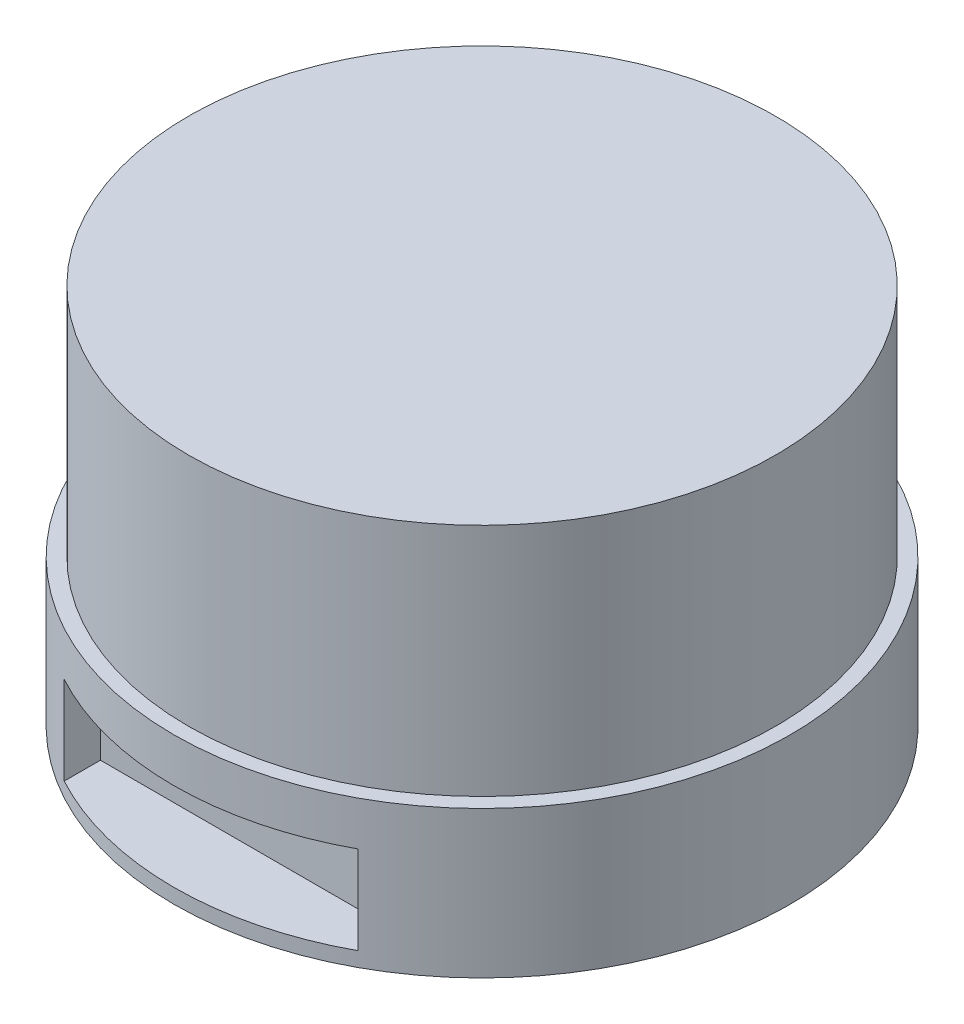
ISO-10303-21;
HEADER;
FILE_DESCRIPTION(('STEP AP214'),'2;1');
FILE_NAME('part.step','',(''),(''),'','','');
FILE_SCHEMA(('AUTOMOTIVE_DESIGN { 1 0 10303 214 1 1 1 1 }'));
ENDSEC;
DATA;
#1=APPLICATION_CONTEXT('core data for automotive mechanical design processes');
#2=APPLICATION_PROTOCOL_DEFINITION('international standard','automotive_design',2000,#1);
#3=PRODUCT_CONTEXT('',#1,'mechanical');
#4=PRODUCT('Part','Part','',(#3));
#5=PRODUCT_RELATED_PRODUCT_CATEGORY('part','',(#4));
#6=PRODUCT_DEFINITION_FORMATION('','',#4);
#7=PRODUCT_DEFINITION_CONTEXT('part definition',#1,'design');
#8=PRODUCT_DEFINITION('design','',#6,#7);
#9=PRODUCT_DEFINITION_SHAPE('','',#8);
#10=(LENGTH_UNIT() NAMED_UNIT(*) SI_UNIT(.MILLI.,.METRE.));
#11=(NAMED_UNIT(*) PLANE_ANGLE_UNIT() SI_UNIT($,.RADIAN.));
#12=(NAMED_UNIT(*) SI_UNIT($,.STERADIAN.) SOLID_ANGLE_UNIT());
#13=UNCERTAINTY_MEASURE_WITH_UNIT(LENGTH_MEASURE(1.E-05),#10,'distance_accuracy_value','');
#14=(GEOMETRIC_REPRESENTATION_CONTEXT(3) GLOBAL_UNCERTAINTY_ASSIGNED_CONTEXT((#13)) GLOBAL_UNIT_ASSIGNED_CONTEXT((#10,
#11,#12)) REPRESENTATION_CONTEXT('',''));
#15=CARTESIAN_POINT('',(0.,0.,0.));
#16=DIRECTION('',(0.,0.,1.));
#17=DIRECTION('',(1.,0.,0.));
#18=AXIS2_PLACEMENT_3D('',#15,#16,#17);
#19=CARTESIAN_POINT('',(0.,10.,0.));
#20=DIRECTION('',(0.,-1.,0.));
#21=DIRECTION('',(0.,0.,-1.));
#22=AXIS2_PLACEMENT_3D('',#19,#20,#21);
#23=CYLINDRICAL_SURFACE('',#22,21.);
#24=DIRECTION('',(0.,-1.,0.));
#25=VECTOR('',#24,1.);
#26=CARTESIAN_POINT('',(10.,10.,18.4661853126194));
#27=LINE('',#26,#25);
#28=CARTESIAN_POINT('',(10.,7.,18.4661853126194));
#29=VERTEX_POINT('',#28);
#30=CARTESIAN_POINT('',(10.,1.,18.4661853126194));
#31=VERTEX_POINT('',#30);
#32=EDGE_CURVE('E11',#29,#31,#27,.T.);
#33=ORIENTED_EDGE('',*,*,#32,.T.);
#34=CARTESIAN_POINT('',(0.,1.,0.));
#35=DIRECTION('',(0.,-1.,0.));
#36=DIRECTION('',(1.,0.,0.));
#37=AXIS2_PLACEMENT_3D('',#34,#35,#36);
#38=CIRCLE('',#37,21.);
#39=CARTESIAN_POINT('',(-10.,1.,18.4661853126194));
#40=VERTEX_POINT('',#39);
#41=EDGE_CURVE('E156',#31,#40,#38,.T.);
#42=ORIENTED_EDGE('',*,*,#41,.T.);
#43=DIRECTION('',(0.,-1.,0.));
#44=VECTOR('',#43,1.);
#45=CARTESIAN_POINT('',(-10.,10.,18.4661853126194));
#46=LINE('',#45,#44);
#47=CARTESIAN_POINT('',(-10.,7.,18.4661853126194));
#48=VERTEX_POINT('',#47);
#49=EDGE_CURVE('E46',#40,#48,#46,.F.);
#50=ORIENTED_EDGE('',*,*,#49,.T.);
#51=CARTESIAN_POINT('',(0.,7.,0.));
#52=DIRECTION('',(0.,1.,0.));
#53=DIRECTION('',(-1.,0.,0.));
#54=AXIS2_PLACEMENT_3D('',#51,#52,#53);
#55=CIRCLE('',#54,21.);
#56=EDGE_CURVE('E61',#48,#29,#55,.T.);
#57=ORIENTED_EDGE('',*,*,#56,.T.);
#58=EDGE_LOOP('',(#33,#42,#50,#57));
#59=FACE_BOUND('',#58,.T.);
#60=CARTESIAN_POINT('',(0.,10.,0.));
#61=DIRECTION('',(0.,1.,0.));
#62=DIRECTION('',(0.,0.,1.));
#63=AXIS2_PLACEMENT_3D('',#60,#61,#62);
#64=CIRCLE('',#63,21.);
#65=CARTESIAN_POINT('',(0.,10.,21.));
#66=VERTEX_POINT('',#65);
#67=EDGE_CURVE('E149',#66,#66,#64,.T.);
#68=ORIENTED_EDGE('',*,*,#67,.F.);
#69=EDGE_LOOP('',(#68));
#70=FACE_BOUND('',#69,.T.);
#71=CARTESIAN_POINT('',(0.,0.,0.));
#72=DIRECTION('',(0.,1.,0.));
#73=DIRECTION('',(0.,0.,1.));
#74=AXIS2_PLACEMENT_3D('',#71,#72,#73);
#75=CIRCLE('',#74,21.);
#76=CARTESIAN_POINT('',(0.,0.,21.));
#77=VERTEX_POINT('',#76);
#78=EDGE_CURVE('E144',#77,#77,#75,.T.);
#79=ORIENTED_EDGE('',*,*,#78,.T.);
#80=EDGE_LOOP('',(#79));
#81=FACE_BOUND('',#80,.T.);
#82=ADVANCED_FACE('F39',(#59,#70,#81),#23,.T.);
#83=CARTESIAN_POINT('',(0.,10.,0.));
#84=DIRECTION('',(0.,1.,0.));
#85=DIRECTION('',(0.,0.,1.));
#86=AXIS2_PLACEMENT_3D('',#83,#84,#85);
#87=PLANE('',#86);
#88=CARTESIAN_POINT('',(0.,10.,0.));
#89=DIRECTION('',(0.,1.,0.));
#90=DIRECTION('',(0.,0.,1.));
#91=AXIS2_PLACEMENT_3D('',#88,#89,#90);
#92=CIRCLE('',#91,20.);
#93=CARTESIAN_POINT('',(0.,10.,20.));
#94=VERTEX_POINT('',#93);
#95=EDGE_CURVE('E145',#94,#94,#92,.T.);
#96=ORIENTED_EDGE('',*,*,#95,.F.);
#97=EDGE_LOOP('',(#96));
#98=FACE_BOUND('',#97,.T.);
#99=ORIENTED_EDGE('',*,*,#67,.T.);
#100=EDGE_LOOP('',(#99));
#101=FACE_BOUND('',#100,.T.);
#102=ADVANCED_FACE('F174',(#98,#101),#87,.T.);
#103=CARTESIAN_POINT('',(0.,0.,0.));
#104=DIRECTION('',(0.,1.,0.));
#105=DIRECTION('',(0.,0.,1.));
#106=AXIS2_PLACEMENT_3D('',#103,#104,#105);
#107=PLANE('',#106);
#108=CARTESIAN_POINT('',(0.,0.,0.));
#109=DIRECTION('',(0.,1.,0.));
#110=DIRECTION('',(0.,0.,1.));
#111=AXIS2_PLACEMENT_3D('',#108,#109,#110);
#112=CIRCLE('',#111,10.);
#113=CARTESIAN_POINT('',(0.,0.,10.));
#114=VERTEX_POINT('',#113);
#115=EDGE_CURVE('E148',#114,#114,#112,.F.);
#116=ORIENTED_EDGE('',*,*,#115,.F.);
#117=EDGE_LOOP('',(#116));
#118=FACE_BOUND('',#117,.T.);
#119=CARTESIAN_POINT('',(-12.7279220613578,0.,12.7279220613572));
#120=DIRECTION('',(0.,-1.,0.));
#121=DIRECTION('',(0.,0.,-1.));
#122=AXIS2_PLACEMENT_3D('',#119,#120,#121);
#123=CIRCLE('',#122,1.50000000000076);
#124=CARTESIAN_POINT('',(-12.7279220613578,0.,11.2279220613564));
#125=VERTEX_POINT('',#124);
#126=EDGE_CURVE('E117',#125,#125,#123,.T.);
#127=ORIENTED_EDGE('',*,*,#126,.F.);
#128=EDGE_LOOP('',(#127));
#129=FACE_BOUND('',#128,.T.);
#130=CARTESIAN_POINT('',(-12.7279220613572,0.,-12.7279220613585));
#131=DIRECTION('',(0.,-1.,0.));
#132=DIRECTION('',(0.,0.,-1.));
#133=AXIS2_PLACEMENT_3D('',#130,#131,#132);
#134=CIRCLE('',#133,1.50000000000051);
#135=CARTESIAN_POINT('',(-12.7279220613572,0.,-14.227922061359));
#136=VERTEX_POINT('',#135);
#137=EDGE_CURVE('E128',#136,#136,#134,.T.);
#138=ORIENTED_EDGE('',*,*,#137,.F.);
#139=EDGE_LOOP('',(#138));
#140=FACE_BOUND('',#139,.T.);
#141=CARTESIAN_POINT('',(12.7279220613585,0.,-12.7279220613579));
#142=DIRECTION('',(0.,-1.,0.));
#143=DIRECTION('',(0.,0.,-1.));
#144=AXIS2_PLACEMENT_3D('',#141,#142,#143);
#145=CIRCLE('',#144,1.49999999999982);
#146=CARTESIAN_POINT('',(12.7279220613585,0.,-14.2279220613577));
#147=VERTEX_POINT('',#146);
#148=EDGE_CURVE('E122',#147,#147,#145,.T.);
#149=ORIENTED_EDGE('',*,*,#148,.F.);
#150=EDGE_LOOP('',(#149));
#151=FACE_BOUND('',#150,.T.);
#152=CARTESIAN_POINT('',(12.7279220613579,0.,12.7279220613578));
#153=DIRECTION('',(0.,-1.,0.));
#154=DIRECTION('',(0.,0.,-1.));
#155=AXIS2_PLACEMENT_3D('',#152,#153,#154);
#156=CIRCLE('',#155,1.5);
#157=CARTESIAN_POINT('',(12.7279220613579,0.,11.2279220613578));
#158=VERTEX_POINT('',#157);
#159=EDGE_CURVE('E121',#158,#158,#156,.T.);
#160=ORIENTED_EDGE('',*,*,#159,.F.);
#161=EDGE_LOOP('',(#160));
#162=FACE_BOUND('',#161,.T.);
#163=ORIENTED_EDGE('',*,*,#78,.F.);
#164=EDGE_LOOP('',(#163));
#165=FACE_BOUND('',#164,.T.);
#166=ADVANCED_FACE('F178',(#118,#129,#140,#151,#162,#165),#107,.F.);
#167=CARTESIAN_POINT('',(0.,26.,0.));
#168=DIRECTION('',(0.,-1.,0.));
#169=DIRECTION('',(0.,0.,-1.));
#170=AXIS2_PLACEMENT_3D('',#167,#168,#169);
#171=CYLINDRICAL_SURFACE('',#170,20.);
#172=CARTESIAN_POINT('',(0.,26.,0.));
#173=DIRECTION('',(0.,1.,0.));
#174=DIRECTION('',(0.,0.,1.));
#175=AXIS2_PLACEMENT_3D('',#172,#173,#174);
#176=CIRCLE('',#175,20.);
#177=CARTESIAN_POINT('',(0.,26.,20.));
#178=VERTEX_POINT('',#177);
#179=EDGE_CURVE('E139',#178,#178,#176,.T.);
#180=ORIENTED_EDGE('',*,*,#179,.F.);
#181=EDGE_LOOP('',(#180));
#182=FACE_BOUND('',#181,.T.);
#183=ORIENTED_EDGE('',*,*,#95,.T.);
#184=EDGE_LOOP('',(#183));
#185=FACE_BOUND('',#184,.T.);
#186=ADVANCED_FACE('F184',(#182,#185),#171,.T.);
#187=CARTESIAN_POINT('',(0.,26.,0.));
#188=DIRECTION('',(0.,1.,0.));
#189=DIRECTION('',(0.,0.,1.));
#190=AXIS2_PLACEMENT_3D('',#187,#188,#189);
#191=PLANE('',#190);
#192=ORIENTED_EDGE('',*,*,#179,.T.);
#193=EDGE_LOOP('',(#192));
#194=FACE_BOUND('',#193,.T.);
#195=ADVANCED_FACE('F191',(#194),#191,.T.);
#196=CARTESIAN_POINT('',(12.7279220613579,4.,12.7279220613578));
#197=DIRECTION('',(0.,-1.,0.));
#198=DIRECTION('',(0.,0.,-1.));
#199=AXIS2_PLACEMENT_3D('',#196,#197,#198);
#200=CYLINDRICAL_SURFACE('',#199,1.5);
#201=CARTESIAN_POINT('',(12.7279220613579,4.,12.7279220613578));
#202=DIRECTION('',(0.,-1.,0.));
#203=DIRECTION('',(0.,0.,-1.));
#204=AXIS2_PLACEMENT_3D('',#201,#202,#203);
#205=CIRCLE('',#204,1.5);
#206=CARTESIAN_POINT('',(12.7279220613579,4.,11.2279220613578));
#207=VERTEX_POINT('',#206);
#208=EDGE_CURVE('E136',#207,#207,#205,.T.);
#209=ORIENTED_EDGE('',*,*,#208,.F.);
#210=EDGE_LOOP('',(#209));
#211=FACE_BOUND('',#210,.T.);
#212=ORIENTED_EDGE('',*,*,#159,.T.);
#213=EDGE_LOOP('',(#212));
#214=FACE_BOUND('',#213,.T.);
#215=ADVANCED_FACE('F195',(#211,#214),#200,.F.);
#216=CARTESIAN_POINT('',(12.7279220613579,4.,12.7279220613578));
#217=DIRECTION('',(0.,-1.,0.));
#218=DIRECTION('',(0.,0.,-1.));
#219=AXIS2_PLACEMENT_3D('',#216,#217,#218);
#220=PLANE('',#219);
#221=ORIENTED_EDGE('',*,*,#208,.T.);
#222=EDGE_LOOP('',(#221));
#223=FACE_BOUND('',#222,.T.);
#224=ADVANCED_FACE('F199',(#223),#220,.T.);
#225=CARTESIAN_POINT('',(12.7279220613585,4.,-12.7279220613579));
#226=DIRECTION('',(0.,-1.,0.));
#227=DIRECTION('',(0.,0.,-1.));
#228=AXIS2_PLACEMENT_3D('',#225,#226,#227);
#229=CYLINDRICAL_SURFACE('',#228,1.49999999999982);
#230=CARTESIAN_POINT('',(12.7279220613585,4.,-12.7279220613579));
#231=DIRECTION('',(0.,-1.,0.));
#232=DIRECTION('',(0.,0.,-1.));
#233=AXIS2_PLACEMENT_3D('',#230,#231,#232);
#234=CIRCLE('',#233,1.49999999999982);
#235=CARTESIAN_POINT('',(12.7279220613585,4.,-14.2279220613577));
#236=VERTEX_POINT('',#235);
#237=EDGE_CURVE('E118',#236,#236,#234,.T.);
#238=ORIENTED_EDGE('',*,*,#237,.F.);
#239=EDGE_LOOP('',(#238));
#240=FACE_BOUND('',#239,.T.);
#241=ORIENTED_EDGE('',*,*,#148,.T.);
#242=EDGE_LOOP('',(#241));
#243=FACE_BOUND('',#242,.T.);
#244=ADVANCED_FACE('F203',(#240,#243),#229,.F.);
#245=CARTESIAN_POINT('',(12.7279220613585,4.,-12.7279220613579));
#246=DIRECTION('',(0.,-1.,0.));
#247=DIRECTION('',(0.,0.,-1.));
#248=AXIS2_PLACEMENT_3D('',#245,#246,#247);
#249=PLANE('',#248);
#250=ORIENTED_EDGE('',*,*,#237,.T.);
#251=EDGE_LOOP('',(#250));
#252=FACE_BOUND('',#251,.T.);
#253=ADVANCED_FACE('F218',(#252),#249,.T.);
#254=CARTESIAN_POINT('',(-12.7279220613572,4.,-12.7279220613585));
#255=DIRECTION('',(0.,-1.,0.));
#256=DIRECTION('',(0.,0.,-1.));
#257=AXIS2_PLACEMENT_3D('',#254,#255,#256);
#258=CYLINDRICAL_SURFACE('',#257,1.50000000000051);
#259=CARTESIAN_POINT('',(-12.7279220613572,4.,-12.7279220613585));
#260=DIRECTION('',(0.,-1.,0.));
#261=DIRECTION('',(0.,0.,-1.));
#262=AXIS2_PLACEMENT_3D('',#259,#260,#261);
#263=CIRCLE('',#262,1.50000000000051);
#264=CARTESIAN_POINT('',(-12.7279220613572,4.,-14.227922061359));
#265=VERTEX_POINT('',#264);
#266=EDGE_CURVE('E125',#265,#265,#263,.T.);
#267=ORIENTED_EDGE('',*,*,#266,.F.);
#268=EDGE_LOOP('',(#267));
#269=FACE_BOUND('',#268,.T.);
#270=ORIENTED_EDGE('',*,*,#137,.T.);
#271=EDGE_LOOP('',(#270));
#272=FACE_BOUND('',#271,.T.);
#273=ADVANCED_FACE('F215',(#269,#272),#258,.F.);
#274=CARTESIAN_POINT('',(-12.7279220613572,4.,-12.7279220613585));
#275=DIRECTION('',(0.,-1.,0.));
#276=DIRECTION('',(0.,0.,-1.));
#277=AXIS2_PLACEMENT_3D('',#274,#275,#276);
#278=PLANE('',#277);
#279=ORIENTED_EDGE('',*,*,#266,.T.);
#280=EDGE_LOOP('',(#279));
#281=FACE_BOUND('',#280,.T.);
#282=ADVANCED_FACE('F209',(#281),#278,.T.);
#283=CARTESIAN_POINT('',(-12.7279220613578,4.,12.7279220613572));
#284=DIRECTION('',(0.,-1.,0.));
#285=DIRECTION('',(0.,0.,-1.));
#286=AXIS2_PLACEMENT_3D('',#283,#284,#285);
#287=CYLINDRICAL_SURFACE('',#286,1.50000000000076);
#288=CARTESIAN_POINT('',(-12.7279220613578,4.,12.7279220613572));
#289=DIRECTION('',(0.,-1.,0.));
#290=DIRECTION('',(0.,0.,-1.));
#291=AXIS2_PLACEMENT_3D('',#288,#289,#290);
#292=CIRCLE('',#291,1.50000000000076);
#293=CARTESIAN_POINT('',(-12.7279220613578,4.,11.2279220613564));
#294=VERTEX_POINT('',#293);
#295=EDGE_CURVE('E131',#294,#294,#292,.T.);
#296=ORIENTED_EDGE('',*,*,#295,.F.);
#297=EDGE_LOOP('',(#296));
#298=FACE_BOUND('',#297,.T.);
#299=ORIENTED_EDGE('',*,*,#126,.T.);
#300=EDGE_LOOP('',(#299));
#301=FACE_BOUND('',#300,.T.);
#302=ADVANCED_FACE('F205',(#298,#301),#287,.F.);
#303=CARTESIAN_POINT('',(-12.7279220613578,4.,12.7279220613572));
#304=DIRECTION('',(0.,-1.,0.));
#305=DIRECTION('',(0.,0.,-1.));
#306=AXIS2_PLACEMENT_3D('',#303,#304,#305);
#307=PLANE('',#306);
#308=ORIENTED_EDGE('',*,*,#295,.T.);
#309=EDGE_LOOP('',(#308));
#310=FACE_BOUND('',#309,.T.);
#311=ADVANCED_FACE('F208',(#310),#307,.T.);
#312=CARTESIAN_POINT('',(0.,-1.5,0.));
#313=DIRECTION('',(0.,-1.,0.));
#314=DIRECTION('',(0.,0.,-1.));
#315=AXIS2_PLACEMENT_3D('',#312,#313,#314);
#316=PLANE('',#315);
#317=CARTESIAN_POINT('',(0.,-1.5,0.));
#318=DIRECTION('',(0.,-1.,0.));
#319=DIRECTION('',(0.,0.,-1.));
#320=AXIS2_PLACEMENT_3D('',#317,#318,#319);
#321=CIRCLE('',#320,10.);
#322=CARTESIAN_POINT('',(0.,-1.5,-10.));
#323=VERTEX_POINT('',#322);
#324=EDGE_CURVE('E112',#323,#323,#321,.T.);
#325=ORIENTED_EDGE('',*,*,#324,.T.);
#326=EDGE_LOOP('',(#325));
#327=FACE_BOUND('',#326,.T.);
#328=CARTESIAN_POINT('',(0.,-1.5,0.));
#329=DIRECTION('',(0.,-1.,0.));
#330=DIRECTION('',(0.,0.,-1.));
#331=AXIS2_PLACEMENT_3D('',#328,#329,#330);
#332=CIRCLE('',#331,9.);
#333=CARTESIAN_POINT('',(0.,-1.5,-9.));
#334=VERTEX_POINT('',#333);
#335=EDGE_CURVE('E109',#334,#334,#332,.T.);
#336=ORIENTED_EDGE('',*,*,#335,.F.);
#337=EDGE_LOOP('',(#336));
#338=FACE_BOUND('',#337,.T.);
#339=ADVANCED_FACE('F213',(#327,#338),#316,.T.);
#340=CARTESIAN_POINT('',(0.,-1.5,0.));
#341=DIRECTION('',(0.,1.,0.));
#342=DIRECTION('',(0.,0.,1.));
#343=AXIS2_PLACEMENT_3D('',#340,#341,#342);
#344=CYLINDRICAL_SURFACE('',#343,10.);
#345=ORIENTED_EDGE('',*,*,#324,.F.);
#346=EDGE_LOOP('',(#345));
#347=FACE_BOUND('',#346,.T.);
#348=ORIENTED_EDGE('',*,*,#115,.T.);
#349=EDGE_LOOP('',(#348));
#350=FACE_BOUND('',#349,.T.);
#351=ADVANCED_FACE('F229',(#347,#350),#344,.T.);
#352=CARTESIAN_POINT('',(0.,-1.5,0.));
#353=DIRECTION('',(0.,1.,0.));
#354=DIRECTION('',(0.,0.,1.));
#355=AXIS2_PLACEMENT_3D('',#352,#353,#354);
#356=CYLINDRICAL_SURFACE('',#355,9.);
#357=ORIENTED_EDGE('',*,*,#335,.T.);
#358=EDGE_LOOP('',(#357));
#359=FACE_BOUND('',#358,.T.);
#360=CARTESIAN_POINT('',(0.,0.,0.));
#361=DIRECTION('',(0.,-1.,0.));
#362=DIRECTION('',(0.,0.,-1.));
#363=AXIS2_PLACEMENT_3D('',#360,#361,#362);
#364=CIRCLE('',#363,9.);
#365=CARTESIAN_POINT('',(0.,0.,-9.));
#366=VERTEX_POINT('',#365);
#367=EDGE_CURVE('E105',#366,#366,#364,.T.);
#368=ORIENTED_EDGE('',*,*,#367,.F.);
#369=EDGE_LOOP('',(#368));
#370=FACE_BOUND('',#369,.T.);
#371=ADVANCED_FACE('F232',(#359,#370),#356,.F.);
#372=ORIENTED_EDGE('',*,*,#367,.T.);
#373=EDGE_LOOP('',(#372));
#374=FACE_BOUND('',#373,.T.);
#375=ADVANCED_FACE('F170',(#374),#107,.F.);
#376=CARTESIAN_POINT('',(-10.,7.,16.));
#377=DIRECTION('',(-1.,0.,0.));
#378=DIRECTION('',(0.,-1.,0.));
#379=AXIS2_PLACEMENT_3D('',#376,#377,#378);
#380=PLANE('',#379);
#381=DIRECTION('',(0.,0.,1.));
#382=VECTOR('',#381,1.);
#383=CARTESIAN_POINT('',(-10.,1.,16.));
#384=LINE('',#383,#382);
#385=CARTESIAN_POINT('',(-10.,1.,16.));
#386=VERTEX_POINT('',#385);
#387=EDGE_CURVE('E53',#386,#40,#384,.T.);
#388=ORIENTED_EDGE('',*,*,#387,.F.);
#389=DIRECTION('',(0.,-1.,0.));
#390=VECTOR('',#389,1.);
#391=CARTESIAN_POINT('',(-10.,7.,16.));
#392=LINE('',#391,#390);
#393=CARTESIAN_POINT('',(-10.,7.,16.));
#394=VERTEX_POINT('',#393);
#395=EDGE_CURVE('E81',#394,#386,#392,.T.);
#396=ORIENTED_EDGE('',*,*,#395,.F.);
#397=DIRECTION('',(0.,0.,1.));
#398=VECTOR('',#397,1.);
#399=CARTESIAN_POINT('',(-10.,7.,16.));
#400=LINE('',#399,#398);
#401=EDGE_CURVE('E103',#394,#48,#400,.T.);
#402=ORIENTED_EDGE('',*,*,#401,.T.);
#403=ORIENTED_EDGE('',*,*,#49,.F.);
#404=EDGE_LOOP('',(#388,#396,#402,#403));
#405=FACE_BOUND('',#404,.T.);
#406=ADVANCED_FACE('F79',(#405),#380,.F.);
#407=CARTESIAN_POINT('',(10.,7.,16.));
#408=DIRECTION('',(0.,1.,0.));
#409=DIRECTION('',(-1.,0.,0.));
#410=AXIS2_PLACEMENT_3D('',#407,#408,#409);
#411=PLANE('',#410);
#412=ORIENTED_EDGE('',*,*,#401,.F.);
#413=DIRECTION('',(-1.,0.,0.));
#414=VECTOR('',#413,1.);
#415=CARTESIAN_POINT('',(10.,7.,16.));
#416=LINE('',#415,#414);
#417=CARTESIAN_POINT('',(10.,7.,16.));
#418=VERTEX_POINT('',#417);
#419=EDGE_CURVE('E86',#418,#394,#416,.T.);
#420=ORIENTED_EDGE('',*,*,#419,.F.);
#421=DIRECTION('',(0.,0.,1.));
#422=VECTOR('',#421,1.);
#423=CARTESIAN_POINT('',(10.,7.,16.));
#424=LINE('',#423,#422);
#425=EDGE_CURVE('E106',#418,#29,#424,.T.);
#426=ORIENTED_EDGE('',*,*,#425,.T.);
#427=ORIENTED_EDGE('',*,*,#56,.F.);
#428=EDGE_LOOP('',(#412,#420,#426,#427));
#429=FACE_BOUND('',#428,.T.);
#430=ADVANCED_FACE('F162',(#429),#411,.F.);
#431=CARTESIAN_POINT('',(10.,1.,16.));
#432=DIRECTION('',(1.,0.,0.));
#433=DIRECTION('',(0.,1.,0.));
#434=AXIS2_PLACEMENT_3D('',#431,#432,#433);
#435=PLANE('',#434);
#436=ORIENTED_EDGE('',*,*,#425,.F.);
#437=DIRECTION('',(0.,1.,0.));
#438=VECTOR('',#437,1.);
#439=CARTESIAN_POINT('',(10.,1.,16.));
#440=LINE('',#439,#438);
#441=CARTESIAN_POINT('',(10.,1.,16.));
#442=VERTEX_POINT('',#441);
#443=EDGE_CURVE('E95',#442,#418,#440,.T.);
#444=ORIENTED_EDGE('',*,*,#443,.F.);
#445=DIRECTION('',(0.,0.,1.));
#446=VECTOR('',#445,1.);
#447=CARTESIAN_POINT('',(10.,1.,16.));
#448=LINE('',#447,#446);
#449=EDGE_CURVE('E85',#442,#31,#448,.T.);
#450=ORIENTED_EDGE('',*,*,#449,.T.);
#451=ORIENTED_EDGE('',*,*,#32,.F.);
#452=EDGE_LOOP('',(#436,#444,#450,#451));
#453=FACE_BOUND('',#452,.T.);
#454=ADVANCED_FACE('F161',(#453),#435,.F.);
#455=CARTESIAN_POINT('',(-10.,1.,16.));
#456=DIRECTION('',(0.,-1.,0.));
#457=DIRECTION('',(1.,0.,0.));
#458=AXIS2_PLACEMENT_3D('',#455,#456,#457);
#459=PLANE('',#458);
#460=ORIENTED_EDGE('',*,*,#449,.F.);
#461=DIRECTION('',(1.,0.,0.));
#462=VECTOR('',#461,1.);
#463=CARTESIAN_POINT('',(-10.,1.,16.));
#464=LINE('',#463,#462);
#465=EDGE_CURVE('E89',#386,#442,#464,.T.);
#466=ORIENTED_EDGE('',*,*,#465,.F.);
#467=ORIENTED_EDGE('',*,*,#387,.T.);
#468=ORIENTED_EDGE('',*,*,#41,.F.);
#469=EDGE_LOOP('',(#460,#466,#467,#468));
#470=FACE_BOUND('',#469,.T.);
#471=ADVANCED_FACE('F90',(#470),#459,.F.);
#472=CARTESIAN_POINT('',(0.,0.,16.));
#473=DIRECTION('',(0.,0.,1.));
#474=DIRECTION('',(1.,0.,0.));
#475=AXIS2_PLACEMENT_3D('',#472,#473,#474);
#476=PLANE('',#475);
#477=ORIENTED_EDGE('',*,*,#395,.T.);
#478=ORIENTED_EDGE('',*,*,#465,.T.);
#479=ORIENTED_EDGE('',*,*,#443,.T.);
#480=ORIENTED_EDGE('',*,*,#419,.T.);
#481=EDGE_LOOP('',(#477,#478,#479,#480));
#482=FACE_BOUND('',#481,.T.);
#483=ADVANCED_FACE('F97',(#482),#476,.T.);
#484=CLOSED_SHELL('',(#82,#102,#166,#186,#195,#215,#224,#244,#253,#273,#282,#302,#311,#339,#351,
#371,#375,#406,#430,#454,#471,#483));
#485=MANIFOLD_SOLID_BREP('B2',#484);
#486=ADVANCED_BREP_SHAPE_REPRESENTATION('',(#18,#485),#14);
#487=SHAPE_DEFINITION_REPRESENTATION(#9,#486);
ENDSEC;
END-ISO-10303-21;
